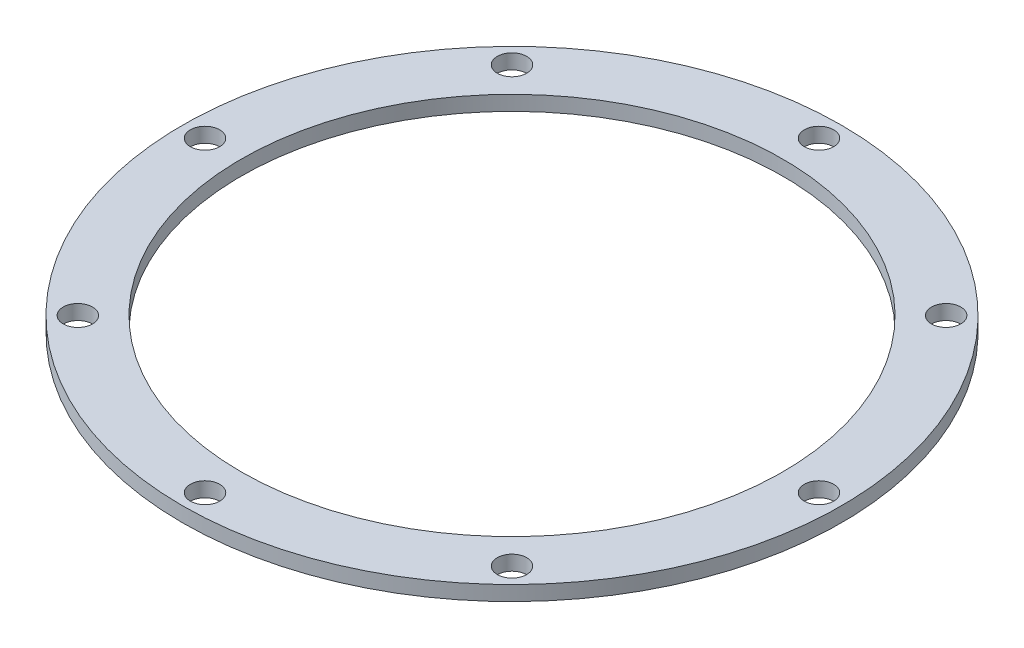
ISO-10303-21;
HEADER;
FILE_DESCRIPTION(('STEP AP214'),'2;1');
FILE_NAME('part.step','',(''),(''),'','','');
FILE_SCHEMA(('AUTOMOTIVE_DESIGN { 1 0 10303 214 1 1 1 1 }'));
ENDSEC;
DATA;
#1=APPLICATION_CONTEXT('core data for automotive mechanical design processes');
#2=APPLICATION_PROTOCOL_DEFINITION('international standard','automotive_design',2000,#1);
#3=PRODUCT_CONTEXT('',#1,'mechanical');
#4=PRODUCT('Part','Part','',(#3));
#5=PRODUCT_RELATED_PRODUCT_CATEGORY('part','',(#4));
#6=PRODUCT_DEFINITION_FORMATION('','',#4);
#7=PRODUCT_DEFINITION_CONTEXT('part definition',#1,'design');
#8=PRODUCT_DEFINITION('design','',#6,#7);
#9=PRODUCT_DEFINITION_SHAPE('','',#8);
#10=(LENGTH_UNIT() NAMED_UNIT(*) SI_UNIT(.MILLI.,.METRE.));
#11=(NAMED_UNIT(*) PLANE_ANGLE_UNIT() SI_UNIT($,.RADIAN.));
#12=(NAMED_UNIT(*) SI_UNIT($,.STERADIAN.) SOLID_ANGLE_UNIT());
#13=UNCERTAINTY_MEASURE_WITH_UNIT(LENGTH_MEASURE(1.E-05),#10,'distance_accuracy_value','');
#14=(GEOMETRIC_REPRESENTATION_CONTEXT(3) GLOBAL_UNCERTAINTY_ASSIGNED_CONTEXT((#13)) GLOBAL_UNIT_ASSIGNED_CONTEXT((#10,
#11,#12)) REPRESENTATION_CONTEXT('',''));
#15=CARTESIAN_POINT('',(0.,0.,0.));
#16=DIRECTION('',(0.,0.,1.));
#17=DIRECTION('',(1.,0.,0.));
#18=AXIS2_PLACEMENT_3D('',#15,#16,#17);
#19=CARTESIAN_POINT('',(0.,3.275,0.));
#20=DIRECTION('',(0.,1.,0.));
#21=DIRECTION('',(0.,0.,1.));
#22=AXIS2_PLACEMENT_3D('',#19,#20,#21);
#23=PLANE('',#22);
#24=CARTESIAN_POINT('',(0.,3.275,68.));
#25=DIRECTION('',(0.,1.,0.));
#26=DIRECTION('',(0.,0.,1.));
#27=AXIS2_PLACEMENT_3D('',#24,#25,#26);
#28=CIRCLE('',#27,3.25);
#29=CARTESIAN_POINT('',(0.,3.275,71.25));
#30=VERTEX_POINT('',#29);
#31=EDGE_CURVE('E82',#30,#30,#28,.T.);
#32=ORIENTED_EDGE('',*,*,#31,.F.);
#33=EDGE_LOOP('',(#32));
#34=FACE_BOUND('',#33,.T.);
#35=CARTESIAN_POINT('',(68.,3.275,0.));
#36=DIRECTION('',(0.,1.,0.));
#37=DIRECTION('',(0.,0.,1.));
#38=AXIS2_PLACEMENT_3D('',#35,#36,#37);
#39=CIRCLE('',#38,3.25000000000001);
#40=CARTESIAN_POINT('',(68.,3.275,3.25));
#41=VERTEX_POINT('',#40);
#42=EDGE_CURVE('E70',#41,#41,#39,.T.);
#43=ORIENTED_EDGE('',*,*,#42,.F.);
#44=EDGE_LOOP('',(#43));
#45=FACE_BOUND('',#44,.T.);
#46=CARTESIAN_POINT('',(0.,3.275,-68.));
#47=DIRECTION('',(0.,1.,0.));
#48=DIRECTION('',(0.,0.,1.));
#49=AXIS2_PLACEMENT_3D('',#46,#47,#48);
#50=CIRCLE('',#49,3.25);
#51=CARTESIAN_POINT('',(0.,3.275,-64.75));
#52=VERTEX_POINT('',#51);
#53=EDGE_CURVE('E58',#52,#52,#50,.T.);
#54=ORIENTED_EDGE('',*,*,#53,.F.);
#55=EDGE_LOOP('',(#54));
#56=FACE_BOUND('',#55,.T.);
#57=CARTESIAN_POINT('',(-68.,3.275,0.));
#58=DIRECTION('',(0.,1.,0.));
#59=DIRECTION('',(0.,0.,1.));
#60=AXIS2_PLACEMENT_3D('',#57,#58,#59);
#61=CIRCLE('',#60,3.25000000000001);
#62=CARTESIAN_POINT('',(-68.,3.275,3.25000000000001));
#63=VERTEX_POINT('',#62);
#64=EDGE_CURVE('E46',#63,#63,#61,.T.);
#65=ORIENTED_EDGE('',*,*,#64,.F.);
#66=EDGE_LOOP('',(#65));
#67=FACE_BOUND('',#66,.T.);
#68=CARTESIAN_POINT('',(0.,3.275,0.));
#69=DIRECTION('',(0.,1.,0.));
#70=DIRECTION('',(0.,0.,1.));
#71=AXIS2_PLACEMENT_3D('',#68,#69,#70);
#72=CIRCLE('',#71,73.);
#73=CARTESIAN_POINT('',(0.,3.275,73.));
#74=VERTEX_POINT('',#73);
#75=EDGE_CURVE('E10',#74,#74,#72,.T.);
#76=ORIENTED_EDGE('',*,*,#75,.T.);
#77=EDGE_LOOP('',(#76));
#78=FACE_BOUND('',#77,.T.);
#79=CARTESIAN_POINT('',(0.,3.275,0.));
#80=DIRECTION('',(0.,1.,0.));
#81=DIRECTION('',(0.,0.,1.));
#82=AXIS2_PLACEMENT_3D('',#79,#80,#81);
#83=CIRCLE('',#82,60.);
#84=CARTESIAN_POINT('',(0.,3.275,60.));
#85=VERTEX_POINT('',#84);
#86=EDGE_CURVE('E41',#85,#85,#83,.T.);
#87=ORIENTED_EDGE('',*,*,#86,.F.);
#88=EDGE_LOOP('',(#87));
#89=FACE_BOUND('',#88,.T.);
#90=CARTESIAN_POINT('',(-48.0832611206852,3.275,-48.0832611206852));
#91=DIRECTION('',(0.,1.,0.));
#92=DIRECTION('',(0.,0.,1.));
#93=AXIS2_PLACEMENT_3D('',#90,#91,#92);
#94=CIRCLE('',#93,3.25);
#95=CARTESIAN_POINT('',(-48.0832611206852,3.275,-44.8332611206852));
#96=VERTEX_POINT('',#95);
#97=EDGE_CURVE('E52',#96,#96,#94,.T.);
#98=ORIENTED_EDGE('',*,*,#97,.F.);
#99=EDGE_LOOP('',(#98));
#100=FACE_BOUND('',#99,.T.);
#101=CARTESIAN_POINT('',(48.0832611206852,3.275,-48.0832611206852));
#102=DIRECTION('',(0.,1.,0.));
#103=DIRECTION('',(0.,0.,1.));
#104=AXIS2_PLACEMENT_3D('',#101,#102,#103);
#105=CIRCLE('',#104,3.25);
#106=CARTESIAN_POINT('',(48.0832611206852,3.275,-44.8332611206852));
#107=VERTEX_POINT('',#106);
#108=EDGE_CURVE('E64',#107,#107,#105,.T.);
#109=ORIENTED_EDGE('',*,*,#108,.F.);
#110=EDGE_LOOP('',(#109));
#111=FACE_BOUND('',#110,.T.);
#112=CARTESIAN_POINT('',(48.0832611206853,3.275,48.0832611206852));
#113=DIRECTION('',(0.,1.,0.));
#114=DIRECTION('',(0.,0.,1.));
#115=AXIS2_PLACEMENT_3D('',#112,#113,#114);
#116=CIRCLE('',#115,3.25);
#117=CARTESIAN_POINT('',(48.0832611206853,3.275,51.3332611206852));
#118=VERTEX_POINT('',#117);
#119=EDGE_CURVE('E76',#118,#118,#116,.T.);
#120=ORIENTED_EDGE('',*,*,#119,.F.);
#121=EDGE_LOOP('',(#120));
#122=FACE_BOUND('',#121,.T.);
#123=CARTESIAN_POINT('',(-48.0832611206852,3.275,48.0832611206853));
#124=DIRECTION('',(0.,1.,0.));
#125=DIRECTION('',(0.,0.,1.));
#126=AXIS2_PLACEMENT_3D('',#123,#124,#125);
#127=CIRCLE('',#126,3.25);
#128=CARTESIAN_POINT('',(-48.0832611206852,3.275,51.3332611206853));
#129=VERTEX_POINT('',#128);
#130=EDGE_CURVE('E88',#129,#129,#127,.T.);
#131=ORIENTED_EDGE('',*,*,#130,.F.);
#132=EDGE_LOOP('',(#131));
#133=FACE_BOUND('',#132,.T.);
#134=ADVANCED_FACE('F30',(#34,#45,#56,#67,#78,#89,#100,#111,#122,#133),#23,.T.);
#135=CARTESIAN_POINT('',(0.,0.,0.));
#136=DIRECTION('',(0.,1.,0.));
#137=DIRECTION('',(0.,0.,1.));
#138=AXIS2_PLACEMENT_3D('',#135,#136,#137);
#139=PLANE('',#138);
#140=CARTESIAN_POINT('',(0.,0.,68.));
#141=DIRECTION('',(0.,1.,0.));
#142=DIRECTION('',(0.,0.,1.));
#143=AXIS2_PLACEMENT_3D('',#140,#141,#142);
#144=CIRCLE('',#143,3.25);
#145=CARTESIAN_POINT('',(0.,0.,71.25));
#146=VERTEX_POINT('',#145);
#147=EDGE_CURVE('E85',#146,#146,#144,.T.);
#148=ORIENTED_EDGE('',*,*,#147,.T.);
#149=EDGE_LOOP('',(#148));
#150=FACE_BOUND('',#149,.T.);
#151=CARTESIAN_POINT('',(68.,0.,0.));
#152=DIRECTION('',(0.,1.,0.));
#153=DIRECTION('',(0.,0.,1.));
#154=AXIS2_PLACEMENT_3D('',#151,#152,#153);
#155=CIRCLE('',#154,3.25000000000001);
#156=CARTESIAN_POINT('',(68.,0.,3.25));
#157=VERTEX_POINT('',#156);
#158=EDGE_CURVE('E73',#157,#157,#155,.T.);
#159=ORIENTED_EDGE('',*,*,#158,.T.);
#160=EDGE_LOOP('',(#159));
#161=FACE_BOUND('',#160,.T.);
#162=CARTESIAN_POINT('',(0.,0.,-68.));
#163=DIRECTION('',(0.,1.,0.));
#164=DIRECTION('',(0.,0.,1.));
#165=AXIS2_PLACEMENT_3D('',#162,#163,#164);
#166=CIRCLE('',#165,3.25);
#167=CARTESIAN_POINT('',(0.,0.,-64.75));
#168=VERTEX_POINT('',#167);
#169=EDGE_CURVE('E61',#168,#168,#166,.T.);
#170=ORIENTED_EDGE('',*,*,#169,.T.);
#171=EDGE_LOOP('',(#170));
#172=FACE_BOUND('',#171,.T.);
#173=CARTESIAN_POINT('',(-68.,0.,0.));
#174=DIRECTION('',(0.,1.,0.));
#175=DIRECTION('',(0.,0.,1.));
#176=AXIS2_PLACEMENT_3D('',#173,#174,#175);
#177=CIRCLE('',#176,3.25000000000001);
#178=CARTESIAN_POINT('',(-68.,0.,3.25000000000001));
#179=VERTEX_POINT('',#178);
#180=EDGE_CURVE('E49',#179,#179,#177,.T.);
#181=ORIENTED_EDGE('',*,*,#180,.T.);
#182=EDGE_LOOP('',(#181));
#183=FACE_BOUND('',#182,.T.);
#184=CARTESIAN_POINT('',(0.,0.,0.));
#185=DIRECTION('',(0.,1.,0.));
#186=DIRECTION('',(0.,0.,1.));
#187=AXIS2_PLACEMENT_3D('',#184,#185,#186);
#188=CIRCLE('',#187,73.);
#189=CARTESIAN_POINT('',(0.,0.,73.));
#190=VERTEX_POINT('',#189);
#191=EDGE_CURVE('E34',#190,#190,#188,.T.);
#192=ORIENTED_EDGE('',*,*,#191,.F.);
#193=EDGE_LOOP('',(#192));
#194=FACE_BOUND('',#193,.T.);
#195=CARTESIAN_POINT('',(0.,0.,0.));
#196=DIRECTION('',(0.,1.,0.));
#197=DIRECTION('',(0.,0.,1.));
#198=AXIS2_PLACEMENT_3D('',#195,#196,#197);
#199=CIRCLE('',#198,60.);
#200=CARTESIAN_POINT('',(0.,0.,60.));
#201=VERTEX_POINT('',#200);
#202=EDGE_CURVE('E43',#201,#201,#199,.T.);
#203=ORIENTED_EDGE('',*,*,#202,.T.);
#204=EDGE_LOOP('',(#203));
#205=FACE_BOUND('',#204,.T.);
#206=CARTESIAN_POINT('',(-48.0832611206852,0.,-48.0832611206852));
#207=DIRECTION('',(0.,1.,0.));
#208=DIRECTION('',(0.,0.,1.));
#209=AXIS2_PLACEMENT_3D('',#206,#207,#208);
#210=CIRCLE('',#209,3.25);
#211=CARTESIAN_POINT('',(-48.0832611206852,0.,-44.8332611206852));
#212=VERTEX_POINT('',#211);
#213=EDGE_CURVE('E55',#212,#212,#210,.T.);
#214=ORIENTED_EDGE('',*,*,#213,.T.);
#215=EDGE_LOOP('',(#214));
#216=FACE_BOUND('',#215,.T.);
#217=CARTESIAN_POINT('',(48.0832611206852,0.,-48.0832611206852));
#218=DIRECTION('',(0.,1.,0.));
#219=DIRECTION('',(0.,0.,1.));
#220=AXIS2_PLACEMENT_3D('',#217,#218,#219);
#221=CIRCLE('',#220,3.25);
#222=CARTESIAN_POINT('',(48.0832611206852,0.,-44.8332611206852));
#223=VERTEX_POINT('',#222);
#224=EDGE_CURVE('E67',#223,#223,#221,.T.);
#225=ORIENTED_EDGE('',*,*,#224,.T.);
#226=EDGE_LOOP('',(#225));
#227=FACE_BOUND('',#226,.T.);
#228=CARTESIAN_POINT('',(48.0832611206853,0.,48.0832611206852));
#229=DIRECTION('',(0.,1.,0.));
#230=DIRECTION('',(0.,0.,1.));
#231=AXIS2_PLACEMENT_3D('',#228,#229,#230);
#232=CIRCLE('',#231,3.25);
#233=CARTESIAN_POINT('',(48.0832611206853,0.,51.3332611206852));
#234=VERTEX_POINT('',#233);
#235=EDGE_CURVE('E79',#234,#234,#232,.T.);
#236=ORIENTED_EDGE('',*,*,#235,.T.);
#237=EDGE_LOOP('',(#236));
#238=FACE_BOUND('',#237,.T.);
#239=CARTESIAN_POINT('',(-48.0832611206852,0.,48.0832611206853));
#240=DIRECTION('',(0.,1.,0.));
#241=DIRECTION('',(0.,0.,1.));
#242=AXIS2_PLACEMENT_3D('',#239,#240,#241);
#243=CIRCLE('',#242,3.25);
#244=CARTESIAN_POINT('',(-48.0832611206852,0.,51.3332611206853));
#245=VERTEX_POINT('',#244);
#246=EDGE_CURVE('E91',#245,#245,#243,.T.);
#247=ORIENTED_EDGE('',*,*,#246,.T.);
#248=EDGE_LOOP('',(#247));
#249=FACE_BOUND('',#248,.T.);
#250=ADVANCED_FACE('F101',(#150,#161,#172,#183,#194,#205,#216,#227,#238,#249),#139,.F.);
#251=CARTESIAN_POINT('',(0.,3.275,0.));
#252=DIRECTION('',(0.,-1.,0.));
#253=DIRECTION('',(0.,0.,-1.));
#254=AXIS2_PLACEMENT_3D('',#251,#252,#253);
#255=CYLINDRICAL_SURFACE('',#254,73.);
#256=ORIENTED_EDGE('',*,*,#75,.F.);
#257=EDGE_LOOP('',(#256));
#258=FACE_BOUND('',#257,.T.);
#259=ORIENTED_EDGE('',*,*,#191,.T.);
#260=EDGE_LOOP('',(#259));
#261=FACE_BOUND('',#260,.T.);
#262=ADVANCED_FACE('F32',(#258,#261),#255,.T.);
#263=CARTESIAN_POINT('',(0.,3.275,0.));
#264=DIRECTION('',(0.,-1.,0.));
#265=DIRECTION('',(0.,0.,-1.));
#266=AXIS2_PLACEMENT_3D('',#263,#264,#265);
#267=CYLINDRICAL_SURFACE('',#266,60.);
#268=ORIENTED_EDGE('',*,*,#86,.T.);
#269=EDGE_LOOP('',(#268));
#270=FACE_BOUND('',#269,.T.);
#271=ORIENTED_EDGE('',*,*,#202,.F.);
#272=EDGE_LOOP('',(#271));
#273=FACE_BOUND('',#272,.T.);
#274=ADVANCED_FACE('F111',(#270,#273),#267,.F.);
#275=CARTESIAN_POINT('',(-68.,3.275,0.));
#276=DIRECTION('',(0.,-1.,0.));
#277=DIRECTION('',(0.,0.,-1.));
#278=AXIS2_PLACEMENT_3D('',#275,#276,#277);
#279=CYLINDRICAL_SURFACE('',#278,3.25000000000001);
#280=ORIENTED_EDGE('',*,*,#64,.T.);
#281=EDGE_LOOP('',(#280));
#282=FACE_BOUND('',#281,.T.);
#283=ORIENTED_EDGE('',*,*,#180,.F.);
#284=EDGE_LOOP('',(#283));
#285=FACE_BOUND('',#284,.T.);
#286=ADVANCED_FACE('F114',(#282,#285),#279,.F.);
#287=CARTESIAN_POINT('',(-48.0832611206852,3.275,-48.0832611206852));
#288=DIRECTION('',(0.,-1.,0.));
#289=DIRECTION('',(0.,0.,-1.));
#290=AXIS2_PLACEMENT_3D('',#287,#288,#289);
#291=CYLINDRICAL_SURFACE('',#290,3.25);
#292=ORIENTED_EDGE('',*,*,#97,.T.);
#293=EDGE_LOOP('',(#292));
#294=FACE_BOUND('',#293,.T.);
#295=ORIENTED_EDGE('',*,*,#213,.F.);
#296=EDGE_LOOP('',(#295));
#297=FACE_BOUND('',#296,.T.);
#298=ADVANCED_FACE('F118',(#294,#297),#291,.F.);
#299=CARTESIAN_POINT('',(0.,3.275,-68.));
#300=DIRECTION('',(0.,-1.,0.));
#301=DIRECTION('',(0.,0.,-1.));
#302=AXIS2_PLACEMENT_3D('',#299,#300,#301);
#303=CYLINDRICAL_SURFACE('',#302,3.25);
#304=ORIENTED_EDGE('',*,*,#53,.T.);
#305=EDGE_LOOP('',(#304));
#306=FACE_BOUND('',#305,.T.);
#307=ORIENTED_EDGE('',*,*,#169,.F.);
#308=EDGE_LOOP('',(#307));
#309=FACE_BOUND('',#308,.T.);
#310=ADVANCED_FACE('F122',(#306,#309),#303,.F.);
#311=CARTESIAN_POINT('',(48.0832611206852,3.275,-48.0832611206852));
#312=DIRECTION('',(0.,-1.,0.));
#313=DIRECTION('',(0.,0.,-1.));
#314=AXIS2_PLACEMENT_3D('',#311,#312,#313);
#315=CYLINDRICAL_SURFACE('',#314,3.25);
#316=ORIENTED_EDGE('',*,*,#108,.T.);
#317=EDGE_LOOP('',(#316));
#318=FACE_BOUND('',#317,.T.);
#319=ORIENTED_EDGE('',*,*,#224,.F.);
#320=EDGE_LOOP('',(#319));
#321=FACE_BOUND('',#320,.T.);
#322=ADVANCED_FACE('F126',(#318,#321),#315,.F.);
#323=CARTESIAN_POINT('',(68.,3.275,0.));
#324=DIRECTION('',(0.,-1.,0.));
#325=DIRECTION('',(0.,0.,-1.));
#326=AXIS2_PLACEMENT_3D('',#323,#324,#325);
#327=CYLINDRICAL_SURFACE('',#326,3.25000000000001);
#328=ORIENTED_EDGE('',*,*,#42,.T.);
#329=EDGE_LOOP('',(#328));
#330=FACE_BOUND('',#329,.T.);
#331=ORIENTED_EDGE('',*,*,#158,.F.);
#332=EDGE_LOOP('',(#331));
#333=FACE_BOUND('',#332,.T.);
#334=ADVANCED_FACE('F130',(#330,#333),#327,.F.);
#335=CARTESIAN_POINT('',(48.0832611206853,3.275,48.0832611206852));
#336=DIRECTION('',(0.,-1.,0.));
#337=DIRECTION('',(0.,0.,-1.));
#338=AXIS2_PLACEMENT_3D('',#335,#336,#337);
#339=CYLINDRICAL_SURFACE('',#338,3.25);
#340=ORIENTED_EDGE('',*,*,#119,.T.);
#341=EDGE_LOOP('',(#340));
#342=FACE_BOUND('',#341,.T.);
#343=ORIENTED_EDGE('',*,*,#235,.F.);
#344=EDGE_LOOP('',(#343));
#345=FACE_BOUND('',#344,.T.);
#346=ADVANCED_FACE('F134',(#342,#345),#339,.F.);
#347=CARTESIAN_POINT('',(0.,3.275,68.));
#348=DIRECTION('',(0.,-1.,0.));
#349=DIRECTION('',(0.,0.,-1.));
#350=AXIS2_PLACEMENT_3D('',#347,#348,#349);
#351=CYLINDRICAL_SURFACE('',#350,3.25);
#352=ORIENTED_EDGE('',*,*,#31,.T.);
#353=EDGE_LOOP('',(#352));
#354=FACE_BOUND('',#353,.T.);
#355=ORIENTED_EDGE('',*,*,#147,.F.);
#356=EDGE_LOOP('',(#355));
#357=FACE_BOUND('',#356,.T.);
#358=ADVANCED_FACE('F138',(#354,#357),#351,.F.);
#359=CARTESIAN_POINT('',(-48.0832611206852,3.275,48.0832611206853));
#360=DIRECTION('',(0.,-1.,0.));
#361=DIRECTION('',(0.,0.,-1.));
#362=AXIS2_PLACEMENT_3D('',#359,#360,#361);
#363=CYLINDRICAL_SURFACE('',#362,3.25);
#364=ORIENTED_EDGE('',*,*,#130,.T.);
#365=EDGE_LOOP('',(#364));
#366=FACE_BOUND('',#365,.T.);
#367=ORIENTED_EDGE('',*,*,#246,.F.);
#368=EDGE_LOOP('',(#367));
#369=FACE_BOUND('',#368,.T.);
#370=ADVANCED_FACE('F97',(#366,#369),#363,.F.);
#371=CLOSED_SHELL('',(#134,#250,#262,#274,#286,#298,#310,#322,#334,#346,#358,#370));
#372=MANIFOLD_SOLID_BREP('B2',#371);
#373=ADVANCED_BREP_SHAPE_REPRESENTATION('',(#18,#372),#14);
#374=SHAPE_DEFINITION_REPRESENTATION(#9,#373);
ENDSEC;
END-ISO-10303-21;
